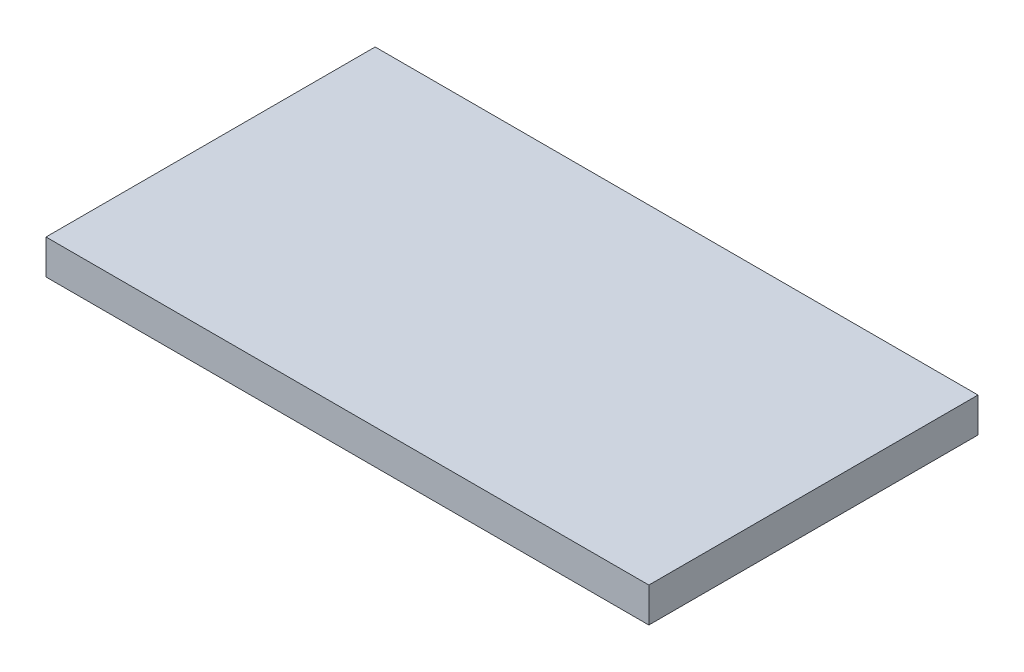
ISO-10303-21;
HEADER;
FILE_DESCRIPTION(('STEP AP214'),'2;1');
FILE_NAME('part.step','',(''),(''),'','','');
FILE_SCHEMA(('AUTOMOTIVE_DESIGN { 1 0 10303 214 1 1 1 1 }'));
ENDSEC;
DATA;
#1=APPLICATION_CONTEXT('core data for automotive mechanical design processes');
#2=APPLICATION_PROTOCOL_DEFINITION('international standard','automotive_design',2000,#1);
#3=PRODUCT_CONTEXT('',#1,'mechanical');
#4=PRODUCT('Part','Part','',(#3));
#5=PRODUCT_RELATED_PRODUCT_CATEGORY('part','',(#4));
#6=PRODUCT_DEFINITION_FORMATION('','',#4);
#7=PRODUCT_DEFINITION_CONTEXT('part definition',#1,'design');
#8=PRODUCT_DEFINITION('design','',#6,#7);
#9=PRODUCT_DEFINITION_SHAPE('','',#8);
#10=(LENGTH_UNIT() NAMED_UNIT(*) SI_UNIT(.MILLI.,.METRE.));
#11=(NAMED_UNIT(*) PLANE_ANGLE_UNIT() SI_UNIT($,.RADIAN.));
#12=(NAMED_UNIT(*) SI_UNIT($,.STERADIAN.) SOLID_ANGLE_UNIT());
#13=UNCERTAINTY_MEASURE_WITH_UNIT(LENGTH_MEASURE(1.E-05),#10,'distance_accuracy_value','');
#14=(GEOMETRIC_REPRESENTATION_CONTEXT(3) GLOBAL_UNCERTAINTY_ASSIGNED_CONTEXT((#13)) GLOBAL_UNIT_ASSIGNED_CONTEXT((#10,
#11,#12)) REPRESENTATION_CONTEXT('',''));
#15=CARTESIAN_POINT('',(0.,0.,0.));
#16=DIRECTION('',(0.,0.,1.));
#17=DIRECTION('',(1.,0.,0.));
#18=AXIS2_PLACEMENT_3D('',#15,#16,#17);
#19=CARTESIAN_POINT('',(0.,0.,0.));
#20=DIRECTION('',(0.,-1.,0.));
#21=DIRECTION('',(0.,0.,-1.));
#22=AXIS2_PLACEMENT_3D('',#19,#20,#21);
#23=PLANE('',#22);
#24=DIRECTION('',(0.,0.,-1.));
#25=VECTOR('',#24,1.);
#26=CARTESIAN_POINT('',(26.1,0.,11.7));
#27=LINE('',#26,#25);
#28=CARTESIAN_POINT('',(26.1,0.,11.7));
#29=VERTEX_POINT('',#28);
#30=CARTESIAN_POINT('',(26.1,0.,-16.8));
#31=VERTEX_POINT('',#30);
#32=EDGE_CURVE('E100',#29,#31,#27,.T.);
#33=ORIENTED_EDGE('',*,*,#32,.F.);
#34=DIRECTION('',(1.,0.,0.));
#35=VECTOR('',#34,1.);
#36=CARTESIAN_POINT('',(-26.1,0.,11.7));
#37=LINE('',#36,#35);
#38=CARTESIAN_POINT('',(-26.1,0.,11.7));
#39=VERTEX_POINT('',#38);
#40=EDGE_CURVE('E50',#39,#29,#37,.T.);
#41=ORIENTED_EDGE('',*,*,#40,.F.);
#42=DIRECTION('',(0.,0.,1.));
#43=VECTOR('',#42,1.);
#44=CARTESIAN_POINT('',(-26.1,0.,11.7));
#45=LINE('',#44,#43);
#46=CARTESIAN_POINT('',(-26.1,0.,-16.8));
#47=VERTEX_POINT('',#46);
#48=EDGE_CURVE('E58',#47,#39,#45,.T.);
#49=ORIENTED_EDGE('',*,*,#48,.F.);
#50=DIRECTION('',(-1.,0.,0.));
#51=VECTOR('',#50,1.);
#52=CARTESIAN_POINT('',(-26.1,0.,-16.8));
#53=LINE('',#52,#51);
#54=EDGE_CURVE('E102',#31,#47,#53,.T.);
#55=ORIENTED_EDGE('',*,*,#54,.F.);
#56=EDGE_LOOP('',(#33,#41,#49,#55));
#57=FACE_BOUND('',#56,.T.);
#58=ADVANCED_FACE('F35',(#57),#23,.T.);
#59=CARTESIAN_POINT('',(26.1,2.5,11.7));
#60=DIRECTION('',(-1.,0.,0.));
#61=DIRECTION('',(0.,0.,1.));
#62=AXIS2_PLACEMENT_3D('',#59,#60,#61);
#63=PLANE('',#62);
#64=ORIENTED_EDGE('',*,*,#32,.T.);
#65=DIRECTION('',(0.,-1.,0.));
#66=VECTOR('',#65,1.);
#67=CARTESIAN_POINT('',(26.1,2.5,-16.8));
#68=LINE('',#67,#66);
#69=CARTESIAN_POINT('',(26.1,3.,-16.8));
#70=VERTEX_POINT('',#69);
#71=EDGE_CURVE('E11',#70,#31,#68,.T.);
#72=ORIENTED_EDGE('',*,*,#71,.F.);
#73=DIRECTION('',(0.,0.,1.));
#74=VECTOR('',#73,1.);
#75=CARTESIAN_POINT('',(26.1,3.,-16.8));
#76=LINE('',#75,#74);
#77=CARTESIAN_POINT('',(26.1,3.,11.7));
#78=VERTEX_POINT('',#77);
#79=EDGE_CURVE('E90',#70,#78,#76,.T.);
#80=ORIENTED_EDGE('',*,*,#79,.T.);
#81=DIRECTION('',(0.,-1.,0.));
#82=VECTOR('',#81,1.);
#83=CARTESIAN_POINT('',(26.1,2.5,11.7));
#84=LINE('',#83,#82);
#85=EDGE_CURVE('E75',#78,#29,#84,.T.);
#86=ORIENTED_EDGE('',*,*,#85,.T.);
#87=EDGE_LOOP('',(#64,#72,#80,#86));
#88=FACE_BOUND('',#87,.T.);
#89=ADVANCED_FACE('F37',(#88),#63,.F.);
#90=CARTESIAN_POINT('',(-26.1,2.5,-16.8));
#91=DIRECTION('',(0.,0.,1.));
#92=DIRECTION('',(1.,0.,0.));
#93=AXIS2_PLACEMENT_3D('',#90,#91,#92);
#94=PLANE('',#93);
#95=ORIENTED_EDGE('',*,*,#54,.T.);
#96=DIRECTION('',(0.,-1.,0.));
#97=VECTOR('',#96,1.);
#98=CARTESIAN_POINT('',(-26.1,2.5,-16.8));
#99=LINE('',#98,#97);
#100=CARTESIAN_POINT('',(-26.1,3.,-16.8));
#101=VERTEX_POINT('',#100);
#102=EDGE_CURVE('E43',#101,#47,#99,.T.);
#103=ORIENTED_EDGE('',*,*,#102,.F.);
#104=DIRECTION('',(1.,0.,0.));
#105=VECTOR('',#104,1.);
#106=CARTESIAN_POINT('',(-26.1,3.,-16.8));
#107=LINE('',#106,#105);
#108=EDGE_CURVE('E98',#101,#70,#107,.T.);
#109=ORIENTED_EDGE('',*,*,#108,.T.);
#110=ORIENTED_EDGE('',*,*,#71,.T.);
#111=EDGE_LOOP('',(#95,#103,#109,#110));
#112=FACE_BOUND('',#111,.T.);
#113=ADVANCED_FACE('F109',(#112),#94,.F.);
#114=CARTESIAN_POINT('',(-26.1,2.5,11.7));
#115=DIRECTION('',(1.,0.,0.));
#116=DIRECTION('',(0.,0.,-1.));
#117=AXIS2_PLACEMENT_3D('',#114,#115,#116);
#118=PLANE('',#117);
#119=ORIENTED_EDGE('',*,*,#48,.T.);
#120=DIRECTION('',(0.,-1.,0.));
#121=VECTOR('',#120,1.);
#122=CARTESIAN_POINT('',(-26.1,2.5,11.7));
#123=LINE('',#122,#121);
#124=CARTESIAN_POINT('',(-26.1,3.,11.7));
#125=VERTEX_POINT('',#124);
#126=EDGE_CURVE('E83',#125,#39,#123,.T.);
#127=ORIENTED_EDGE('',*,*,#126,.F.);
#128=DIRECTION('',(0.,0.,-1.));
#129=VECTOR('',#128,1.);
#130=CARTESIAN_POINT('',(-26.1,3.,11.7));
#131=LINE('',#130,#129);
#132=EDGE_CURVE('E93',#125,#101,#131,.T.);
#133=ORIENTED_EDGE('',*,*,#132,.T.);
#134=ORIENTED_EDGE('',*,*,#102,.T.);
#135=EDGE_LOOP('',(#119,#127,#133,#134));
#136=FACE_BOUND('',#135,.T.);
#137=ADVANCED_FACE('F106',(#136),#118,.F.);
#138=CARTESIAN_POINT('',(-26.1,2.5,11.7));
#139=DIRECTION('',(0.,0.,-1.));
#140=DIRECTION('',(-1.,0.,0.));
#141=AXIS2_PLACEMENT_3D('',#138,#139,#140);
#142=PLANE('',#141);
#143=ORIENTED_EDGE('',*,*,#40,.T.);
#144=ORIENTED_EDGE('',*,*,#85,.F.);
#145=DIRECTION('',(-1.,0.,0.));
#146=VECTOR('',#145,1.);
#147=CARTESIAN_POINT('',(26.1,3.,11.7));
#148=LINE('',#147,#146);
#149=EDGE_CURVE('E78',#78,#125,#148,.T.);
#150=ORIENTED_EDGE('',*,*,#149,.T.);
#151=ORIENTED_EDGE('',*,*,#126,.T.);
#152=EDGE_LOOP('',(#143,#144,#150,#151));
#153=FACE_BOUND('',#152,.T.);
#154=ADVANCED_FACE('F77',(#153),#142,.F.);
#155=CARTESIAN_POINT('',(0.,3.,0.));
#156=DIRECTION('',(0.,-1.,0.));
#157=DIRECTION('',(0.,0.,-1.));
#158=AXIS2_PLACEMENT_3D('',#155,#156,#157);
#159=PLANE('',#158);
#160=ORIENTED_EDGE('',*,*,#79,.F.);
#161=ORIENTED_EDGE('',*,*,#108,.F.);
#162=ORIENTED_EDGE('',*,*,#132,.F.);
#163=ORIENTED_EDGE('',*,*,#149,.F.);
#164=EDGE_LOOP('',(#160,#161,#162,#163));
#165=FACE_BOUND('',#164,.T.);
#166=ADVANCED_FACE('F88',(#165),#159,.F.);
#167=CLOSED_SHELL('',(#58,#89,#113,#137,#154,#166));
#168=MANIFOLD_SOLID_BREP('B2',#167);
#169=ADVANCED_BREP_SHAPE_REPRESENTATION('',(#18,#168),#14);
#170=SHAPE_DEFINITION_REPRESENTATION(#9,#169);
ENDSEC;
END-ISO-10303-21;
